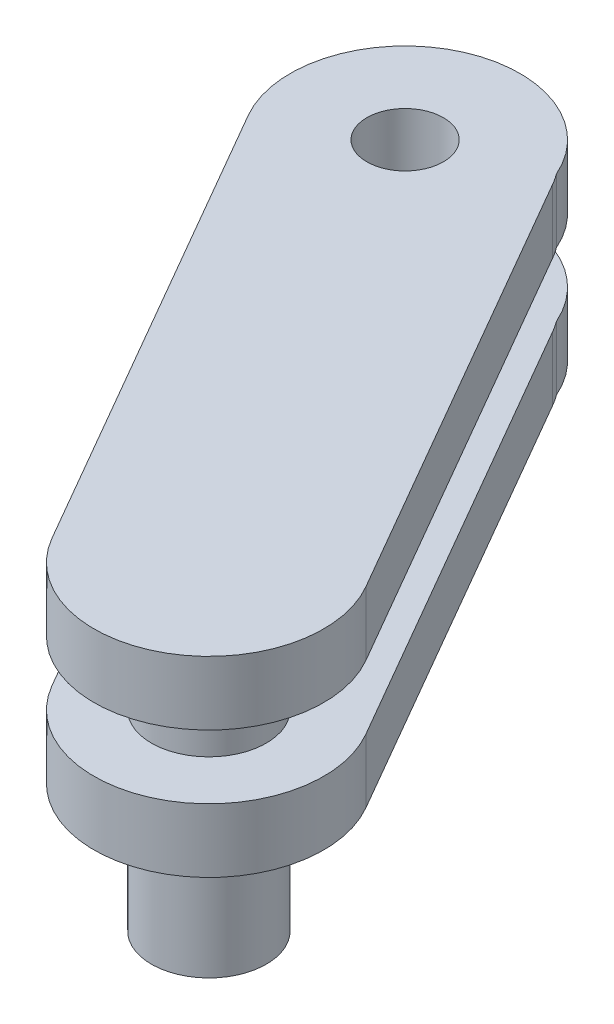
ISO-10303-21;
HEADER;
FILE_DESCRIPTION(('STEP AP214'),'2;1');
FILE_NAME('part.step','',(''),(''),'','','');
FILE_SCHEMA(('AUTOMOTIVE_DESIGN { 1 0 10303 214 1 1 1 1 }'));
ENDSEC;
DATA;
#1=APPLICATION_CONTEXT('core data for automotive mechanical design processes');
#2=APPLICATION_PROTOCOL_DEFINITION('international standard','automotive_design',2000,#1);
#3=PRODUCT_CONTEXT('',#1,'mechanical');
#4=PRODUCT('Part','Part','',(#3));
#5=PRODUCT_RELATED_PRODUCT_CATEGORY('part','',(#4));
#6=PRODUCT_DEFINITION_FORMATION('','',#4);
#7=PRODUCT_DEFINITION_CONTEXT('part definition',#1,'design');
#8=PRODUCT_DEFINITION('design','',#6,#7);
#9=PRODUCT_DEFINITION_SHAPE('','',#8);
#10=(LENGTH_UNIT() NAMED_UNIT(*) SI_UNIT(.MILLI.,.METRE.));
#11=(NAMED_UNIT(*) PLANE_ANGLE_UNIT() SI_UNIT($,.RADIAN.));
#12=(NAMED_UNIT(*) SI_UNIT($,.STERADIAN.) SOLID_ANGLE_UNIT());
#13=UNCERTAINTY_MEASURE_WITH_UNIT(LENGTH_MEASURE(1.E-05),#10,'distance_accuracy_value','');
#14=(GEOMETRIC_REPRESENTATION_CONTEXT(3) GLOBAL_UNCERTAINTY_ASSIGNED_CONTEXT((#13)) GLOBAL_UNIT_ASSIGNED_CONTEXT((#10,
#11,#12)) REPRESENTATION_CONTEXT('',''));
#15=CARTESIAN_POINT('',(0.,0.,0.));
#16=DIRECTION('',(0.,0.,1.));
#17=DIRECTION('',(1.,0.,0.));
#18=AXIS2_PLACEMENT_3D('',#15,#16,#17);
#19=CARTESIAN_POINT('',(-379.944100226322,100.,-20.7982370649041));
#20=DIRECTION('',(0.,1.,0.));
#21=DIRECTION('',(1.,0.,0.));
#22=AXIS2_PLACEMENT_3D('',#19,#20,#21);
#23=PLANE('',#22);
#24=CARTESIAN_POINT('',(-434.944100226293,100.,-116.061031481164));
#25=DIRECTION('',(0.,-1.,0.));
#26=DIRECTION('',(0.,0.,-1.));
#27=AXIS2_PLACEMENT_3D('',#24,#25,#26);
#28=CIRCLE('',#27,15.);
#29=CARTESIAN_POINT('',(-434.944100226293,100.,-131.061031481164));
#30=VERTEX_POINT('',#29);
#31=EDGE_CURVE('E635',#30,#30,#28,.T.);
#32=ORIENTED_EDGE('',*,*,#31,.F.);
#33=EDGE_LOOP('',(#32));
#34=FACE_BOUND('',#33,.T.);
#35=CARTESIAN_POINT('',(-429.944100226293,100.,-107.40077744332));
#36=DIRECTION('',(0.,1.,0.));
#37=DIRECTION('',(0.866025403783927,0.,-0.500000000000886));
#38=AXIS2_PLACEMENT_3D('',#35,#36,#37);
#39=CIRCLE('',#38,45.0000000000028);
#40=CARTESIAN_POINT('',(-390.972957056014,100.,-129.900777443361));
#41=VERTEX_POINT('',#40);
#42=CARTESIAN_POINT('',(-393.714266764155,100.,-134.091584237159));
#43=VERTEX_POINT('',#42);
#44=EDGE_CURVE('E220',#41,#43,#39,.T.);
#45=ORIENTED_EDGE('',*,*,#44,.F.);
#46=DIRECTION('',(-0.500000000000443,0.,-0.866025403784183));
#47=VECTOR('',#46,1.);
#48=CARTESIAN_POINT('',(-290.972957055926,100.,43.3043033134757));
#49=LINE('',#48,#47);
#50=CARTESIAN_POINT('',(-290.972956581911,100.,43.3043041348106));
#51=VERTEX_POINT('',#50);
#52=EDGE_CURVE('E239',#51,#41,#49,.T.);
#53=ORIENTED_EDGE('',*,*,#52,.F.);
#54=CARTESIAN_POINT('',(-329.944100226293,100.,65.8043033135681));
#55=DIRECTION('',(0.,1.,0.));
#56=DIRECTION('',(-0.866025403783927,0.,0.500000000000886));
#57=AXIS2_PLACEMENT_3D('',#54,#55,#56);
#58=CIRCLE('',#57,44.9999999999462);
#59=CARTESIAN_POINT('',(-368.915243396523,100.,88.304303313581));
#60=VERTEX_POINT('',#59);
#61=EDGE_CURVE('E53',#60,#51,#58,.T.);
#62=ORIENTED_EDGE('',*,*,#61,.F.);
#63=DIRECTION('',(0.500000000000442,0.,0.866025403784183));
#64=VECTOR('',#63,1.);
#65=CARTESIAN_POINT('',(-468.915243396612,100.,-84.9007774432555));
#66=LINE('',#65,#64);
#67=CARTESIAN_POINT('',(-473.915243396646,100.,-93.561031481193));
#68=VERTEX_POINT('',#67);
#69=EDGE_CURVE('E211',#68,#60,#66,.T.);
#70=ORIENTED_EDGE('',*,*,#69,.F.);
#71=CARTESIAN_POINT('',(-434.944100226293,100.,-116.061031481164));
#72=DIRECTION('',(0.,-1.,0.));
#73=DIRECTION('',(0.,0.,-1.));
#74=AXIS2_PLACEMENT_3D('',#71,#72,#73);
#75=CIRCLE('',#74,45.0000000000257);
#76=EDGE_CURVE('E184',#68,#43,#75,.T.);
#77=ORIENTED_EDGE('',*,*,#76,.T.);
#78=EDGE_LOOP('',(#45,#53,#62,#70,#77));
#79=FACE_BOUND('',#78,.T.);
#80=CARTESIAN_POINT('',(-329.944100226293,100.,65.8043033135681));
#81=DIRECTION('',(0.,-1.,0.));
#82=DIRECTION('',(1.,0.,0.));
#83=AXIS2_PLACEMENT_3D('',#80,#81,#82);
#84=CIRCLE('',#83,22.5);
#85=CARTESIAN_POINT('',(-352.444100226293,100.,65.8043033135681));
#86=VERTEX_POINT('',#85);
#87=EDGE_CURVE('E254',#86,#86,#84,.T.);
#88=ORIENTED_EDGE('',*,*,#87,.F.);
#89=EDGE_LOOP('',(#88));
#90=FACE_BOUND('',#89,.T.);
#91=ADVANCED_FACE('F43',(#34,#79,#90),#23,.F.);
#92=CARTESIAN_POINT('',(-379.944100226322,125.,-20.7982370649041));
#93=DIRECTION('',(0.,1.,0.));
#94=DIRECTION('',(1.,0.,0.));
#95=AXIS2_PLACEMENT_3D('',#92,#93,#94);
#96=PLANE('',#95);
#97=CARTESIAN_POINT('',(-434.944100226293,125.,-116.061031481164));
#98=DIRECTION('',(0.,1.,0.));
#99=DIRECTION('',(0.,0.,1.));
#100=AXIS2_PLACEMENT_3D('',#97,#98,#99);
#101=CIRCLE('',#100,15.);
#102=CARTESIAN_POINT('',(-434.944100226293,125.,-101.061031481164));
#103=VERTEX_POINT('',#102);
#104=EDGE_CURVE('E174',#103,#103,#101,.T.);
#105=ORIENTED_EDGE('',*,*,#104,.F.);
#106=EDGE_LOOP('',(#105));
#107=FACE_BOUND('',#106,.T.);
#108=DIRECTION('',(-0.500000000000443,0.,-0.866025403784183));
#109=VECTOR('',#108,1.);
#110=CARTESIAN_POINT('',(-290.972957055926,125.,43.3043033134757));
#111=LINE('',#110,#109);
#112=CARTESIAN_POINT('',(-290.972956581911,125.,43.3043041348106));
#113=VERTEX_POINT('',#112);
#114=CARTESIAN_POINT('',(-390.972957056014,125.,-129.900777443361));
#115=VERTEX_POINT('',#114);
#116=EDGE_CURVE('E263',#113,#115,#111,.T.);
#117=ORIENTED_EDGE('',*,*,#116,.T.);
#118=CARTESIAN_POINT('',(-429.944100226293,125.,-107.40077744332));
#119=DIRECTION('',(0.,1.,0.));
#120=DIRECTION('',(0.866025403783927,0.,-0.500000000000886));
#121=AXIS2_PLACEMENT_3D('',#118,#119,#120);
#122=CIRCLE('',#121,45.0000000000028);
#123=CARTESIAN_POINT('',(-393.714266764155,125.,-134.091584237159));
#124=VERTEX_POINT('',#123);
#125=EDGE_CURVE('E221',#115,#124,#122,.T.);
#126=ORIENTED_EDGE('',*,*,#125,.T.);
#127=CARTESIAN_POINT('',(-434.944100226293,125.,-116.061031481164));
#128=DIRECTION('',(0.,1.,0.));
#129=DIRECTION('',(0.,0.,1.));
#130=AXIS2_PLACEMENT_3D('',#127,#128,#129);
#131=CIRCLE('',#130,45.0000000000257);
#132=CARTESIAN_POINT('',(-473.915243396646,125.,-93.561031481193));
#133=VERTEX_POINT('',#132);
#134=EDGE_CURVE('E190',#133,#124,#131,.F.);
#135=ORIENTED_EDGE('',*,*,#134,.F.);
#136=DIRECTION('',(0.500000000000442,0.,0.866025403784183));
#137=VECTOR('',#136,1.);
#138=CARTESIAN_POINT('',(-468.915243396612,125.,-84.9007774432555));
#139=LINE('',#138,#137);
#140=CARTESIAN_POINT('',(-368.915243396523,125.,88.304303313581));
#141=VERTEX_POINT('',#140);
#142=EDGE_CURVE('E210',#133,#141,#139,.T.);
#143=ORIENTED_EDGE('',*,*,#142,.T.);
#144=CARTESIAN_POINT('',(-329.944100226293,125.,65.8043033135681));
#145=DIRECTION('',(0.,1.,0.));
#146=DIRECTION('',(-0.866025403783927,0.,0.500000000000886));
#147=AXIS2_PLACEMENT_3D('',#144,#145,#146);
#148=CIRCLE('',#147,44.9999999999462);
#149=EDGE_CURVE('E11',#141,#113,#148,.T.);
#150=ORIENTED_EDGE('',*,*,#149,.T.);
#151=EDGE_LOOP('',(#117,#126,#135,#143,#150));
#152=FACE_BOUND('',#151,.T.);
#153=CARTESIAN_POINT('',(-329.944100226293,125.,65.8043033135681));
#154=DIRECTION('',(0.,-1.,0.));
#155=DIRECTION('',(1.,0.,0.));
#156=AXIS2_PLACEMENT_3D('',#153,#154,#155);
#157=CIRCLE('',#156,22.5);
#158=CARTESIAN_POINT('',(-352.444100226293,125.,65.8043033135681));
#159=VERTEX_POINT('',#158);
#160=EDGE_CURVE('E216',#159,#159,#157,.T.);
#161=ORIENTED_EDGE('',*,*,#160,.T.);
#162=EDGE_LOOP('',(#161));
#163=FACE_BOUND('',#162,.T.);
#164=ADVANCED_FACE('F306',(#107,#152,#163),#96,.T.);
#165=CARTESIAN_POINT('',(-329.944100226293,100.,65.8043033135681));
#166=DIRECTION('',(0.,1.,0.));
#167=DIRECTION('',(-0.866025403783927,0.,0.500000000000886));
#168=AXIS2_PLACEMENT_3D('',#165,#166,#167);
#169=CYLINDRICAL_SURFACE('',#168,44.9999999999462);
#170=ORIENTED_EDGE('',*,*,#61,.T.);
#171=DIRECTION('',(0.,1.,0.));
#172=VECTOR('',#171,1.);
#173=CARTESIAN_POINT('',(-290.972956581911,100.,43.3043041348106));
#174=LINE('',#173,#172);
#175=EDGE_CURVE('E233',#51,#113,#174,.T.);
#176=ORIENTED_EDGE('',*,*,#175,.T.);
#177=ORIENTED_EDGE('',*,*,#149,.F.);
#178=DIRECTION('',(0.,1.,0.));
#179=VECTOR('',#178,1.);
#180=CARTESIAN_POINT('',(-368.915243396523,100.,88.304303313581));
#181=LINE('',#180,#179);
#182=EDGE_CURVE('E206',#60,#141,#181,.T.);
#183=ORIENTED_EDGE('',*,*,#182,.F.);
#184=EDGE_LOOP('',(#170,#176,#177,#183));
#185=FACE_BOUND('',#184,.T.);
#186=ADVANCED_FACE('F313',(#185),#169,.T.);
#187=CARTESIAN_POINT('',(-290.972957055926,100.,43.3043033134757));
#188=DIRECTION('',(0.866025403784183,0.,-0.500000000000443));
#189=DIRECTION('',(0.,-1.,0.));
#190=AXIS2_PLACEMENT_3D('',#187,#188,#189);
#191=PLANE('',#190);
#192=ORIENTED_EDGE('',*,*,#52,.T.);
#193=DIRECTION('',(0.,1.,0.));
#194=VECTOR('',#193,1.);
#195=CARTESIAN_POINT('',(-390.972957056014,100.,-129.900777443361));
#196=LINE('',#195,#194);
#197=EDGE_CURVE('E224',#41,#115,#196,.T.);
#198=ORIENTED_EDGE('',*,*,#197,.T.);
#199=ORIENTED_EDGE('',*,*,#116,.F.);
#200=ORIENTED_EDGE('',*,*,#175,.F.);
#201=EDGE_LOOP('',(#192,#198,#199,#200));
#202=FACE_BOUND('',#201,.T.);
#203=ADVANCED_FACE('F332',(#202),#191,.T.);
#204=CARTESIAN_POINT('',(-429.944100226293,100.,-107.40077744332));
#205=DIRECTION('',(0.,1.,0.));
#206=DIRECTION('',(0.866025403783927,0.,-0.500000000000886));
#207=AXIS2_PLACEMENT_3D('',#204,#205,#206);
#208=CYLINDRICAL_SURFACE('',#207,45.0000000000028);
#209=DIRECTION('',(0.,-1.,0.));
#210=VECTOR('',#209,1.);
#211=CARTESIAN_POINT('',(-393.714266764155,252.279220613651,-134.091584237159));
#212=LINE('',#211,#210);
#213=EDGE_CURVE('E194',#124,#43,#212,.T.);
#214=ORIENTED_EDGE('',*,*,#213,.F.);
#215=ORIENTED_EDGE('',*,*,#125,.F.);
#216=ORIENTED_EDGE('',*,*,#197,.F.);
#217=ORIENTED_EDGE('',*,*,#44,.T.);
#218=EDGE_LOOP('',(#214,#215,#216,#217));
#219=FACE_BOUND('',#218,.T.);
#220=ADVANCED_FACE('F45',(#219),#208,.T.);
#221=CARTESIAN_POINT('',(-468.915243396612,100.,-84.9007774432555));
#222=DIRECTION('',(-0.866025403784183,0.,0.500000000000442));
#223=DIRECTION('',(0.,1.,0.));
#224=AXIS2_PLACEMENT_3D('',#221,#222,#223);
#225=PLANE('',#224);
#226=ORIENTED_EDGE('',*,*,#69,.T.);
#227=ORIENTED_EDGE('',*,*,#182,.T.);
#228=ORIENTED_EDGE('',*,*,#142,.F.);
#229=DIRECTION('',(0.,-1.,0.));
#230=VECTOR('',#229,1.);
#231=CARTESIAN_POINT('',(-473.915243396646,252.279220613651,-93.561031481193));
#232=LINE('',#231,#230);
#233=EDGE_CURVE('E189',#133,#68,#232,.T.);
#234=ORIENTED_EDGE('',*,*,#233,.T.);
#235=EDGE_LOOP('',(#226,#227,#228,#234));
#236=FACE_BOUND('',#235,.T.);
#237=ADVANCED_FACE('F334',(#236),#225,.T.);
#238=CARTESIAN_POINT('',(-379.944100226322,150.,-20.7982370649041));
#239=DIRECTION('',(0.,1.,0.));
#240=DIRECTION('',(1.,0.,0.));
#241=AXIS2_PLACEMENT_3D('',#238,#239,#240);
#242=PLANE('',#241);
#243=CARTESIAN_POINT('',(-434.944100226293,150.,-116.061031481164));
#244=DIRECTION('',(0.,1.,0.));
#245=DIRECTION('',(0.,0.,1.));
#246=AXIS2_PLACEMENT_3D('',#243,#244,#245);
#247=CIRCLE('',#246,15.);
#248=CARTESIAN_POINT('',(-434.944100226293,150.,-101.061031481164));
#249=VERTEX_POINT('',#248);
#250=EDGE_CURVE('E180',#249,#249,#247,.T.);
#251=ORIENTED_EDGE('',*,*,#250,.T.);
#252=EDGE_LOOP('',(#251));
#253=FACE_BOUND('',#252,.T.);
#254=CARTESIAN_POINT('',(-329.944100226293,150.,65.8043033135681));
#255=DIRECTION('',(0.,-1.,0.));
#256=DIRECTION('',(1.,0.,0.));
#257=AXIS2_PLACEMENT_3D('',#254,#255,#256);
#258=CIRCLE('',#257,22.5);
#259=CARTESIAN_POINT('',(-352.444100226293,150.,65.8043033135681));
#260=VERTEX_POINT('',#259);
#261=EDGE_CURVE('E188',#260,#260,#258,.T.);
#262=ORIENTED_EDGE('',*,*,#261,.F.);
#263=EDGE_LOOP('',(#262));
#264=FACE_BOUND('',#263,.T.);
#265=CARTESIAN_POINT('',(-329.944100226293,150.,65.8043033135681));
#266=DIRECTION('',(0.,1.,0.));
#267=DIRECTION('',(-0.866025403783927,0.,0.500000000000886));
#268=AXIS2_PLACEMENT_3D('',#265,#266,#267);
#269=CIRCLE('',#268,44.9999999999462);
#270=CARTESIAN_POINT('',(-368.915243396523,150.,88.304303313581));
#271=VERTEX_POINT('',#270);
#272=CARTESIAN_POINT('',(-290.972956581911,150.,43.3043041348106));
#273=VERTEX_POINT('',#272);
#274=EDGE_CURVE('E245',#271,#273,#269,.T.);
#275=ORIENTED_EDGE('',*,*,#274,.F.);
#276=DIRECTION('',(0.500000000000442,0.,0.866025403784183));
#277=VECTOR('',#276,1.);
#278=CARTESIAN_POINT('',(-468.915243396612,150.,-84.9007774432555));
#279=LINE('',#278,#277);
#280=CARTESIAN_POINT('',(-473.915243396642,150.,-93.5610314811953));
#281=VERTEX_POINT('',#280);
#282=EDGE_CURVE('E244',#281,#271,#279,.T.);
#283=ORIENTED_EDGE('',*,*,#282,.F.);
#284=CARTESIAN_POINT('',(-434.944100226293,150.,-116.061031481164));
#285=DIRECTION('',(0.,1.,0.));
#286=DIRECTION('',(0.,0.,1.));
#287=AXIS2_PLACEMENT_3D('',#284,#285,#286);
#288=CIRCLE('',#287,45.0000000000272);
#289=CARTESIAN_POINT('',(-393.714266764151,150.,-134.091584237153));
#290=VERTEX_POINT('',#289);
#291=EDGE_CURVE('E168',#281,#290,#288,.F.);
#292=ORIENTED_EDGE('',*,*,#291,.T.);
#293=CARTESIAN_POINT('',(-429.944100226293,150.,-107.40077744332));
#294=DIRECTION('',(0.,1.,0.));
#295=DIRECTION('',(0.866025403783927,0.,-0.500000000000886));
#296=AXIS2_PLACEMENT_3D('',#293,#294,#295);
#297=CIRCLE('',#296,45.0000000000028);
#298=CARTESIAN_POINT('',(-390.972957056014,150.,-129.900777443361));
#299=VERTEX_POINT('',#298);
#300=EDGE_CURVE('E66',#299,#290,#297,.T.);
#301=ORIENTED_EDGE('',*,*,#300,.F.);
#302=DIRECTION('',(-0.500000000000443,0.,-0.866025403784183));
#303=VECTOR('',#302,1.);
#304=CARTESIAN_POINT('',(-290.972957055926,150.,43.3043033134757));
#305=LINE('',#304,#303);
#306=EDGE_CURVE('E205',#273,#299,#305,.T.);
#307=ORIENTED_EDGE('',*,*,#306,.F.);
#308=EDGE_LOOP('',(#275,#283,#292,#301,#307));
#309=FACE_BOUND('',#308,.T.);
#310=ADVANCED_FACE('F282',(#253,#264,#309),#242,.F.);
#311=CARTESIAN_POINT('',(-379.944100226322,175.,-20.7982370649041));
#312=DIRECTION('',(0.,1.,0.));
#313=DIRECTION('',(1.,0.,0.));
#314=AXIS2_PLACEMENT_3D('',#311,#312,#313);
#315=PLANE('',#314);
#316=CARTESIAN_POINT('',(-434.944100226293,175.,-116.061031481164));
#317=DIRECTION('',(0.,-1.,0.));
#318=DIRECTION('',(0.,0.,-1.));
#319=AXIS2_PLACEMENT_3D('',#316,#317,#318);
#320=CIRCLE('',#319,15.);
#321=CARTESIAN_POINT('',(-434.944100226293,175.,-131.061031481164));
#322=VERTEX_POINT('',#321);
#323=EDGE_CURVE('E637',#322,#322,#320,.T.);
#324=ORIENTED_EDGE('',*,*,#323,.T.);
#325=EDGE_LOOP('',(#324));
#326=FACE_BOUND('',#325,.T.);
#327=CARTESIAN_POINT('',(-329.944100226293,175.,65.8043033135681));
#328=DIRECTION('',(0.,1.,0.));
#329=DIRECTION('',(-0.866025403783927,0.,0.500000000000886));
#330=AXIS2_PLACEMENT_3D('',#327,#328,#329);
#331=CIRCLE('',#330,44.9999999999462);
#332=CARTESIAN_POINT('',(-368.915243396523,175.,88.304303313581));
#333=VERTEX_POINT('',#332);
#334=CARTESIAN_POINT('',(-290.972956581911,175.,43.3043041348106));
#335=VERTEX_POINT('',#334);
#336=EDGE_CURVE('E248',#333,#335,#331,.T.);
#337=ORIENTED_EDGE('',*,*,#336,.T.);
#338=DIRECTION('',(-0.500000000000443,0.,-0.866025403784183));
#339=VECTOR('',#338,1.);
#340=CARTESIAN_POINT('',(-290.972957055926,175.,43.3043033134757));
#341=LINE('',#340,#339);
#342=CARTESIAN_POINT('',(-390.972957056014,175.,-129.900777443361));
#343=VERTEX_POINT('',#342);
#344=EDGE_CURVE('E226',#335,#343,#341,.T.);
#345=ORIENTED_EDGE('',*,*,#344,.T.);
#346=CARTESIAN_POINT('',(-429.944100226293,175.,-107.40077744332));
#347=DIRECTION('',(0.,1.,0.));
#348=DIRECTION('',(0.866025403783927,0.,-0.500000000000886));
#349=AXIS2_PLACEMENT_3D('',#346,#347,#348);
#350=CIRCLE('',#349,45.0000000000028);
#351=CARTESIAN_POINT('',(-393.714266764155,175.,-134.091584237159));
#352=VERTEX_POINT('',#351);
#353=EDGE_CURVE('E172',#343,#352,#350,.T.);
#354=ORIENTED_EDGE('',*,*,#353,.T.);
#355=CARTESIAN_POINT('',(-434.944100226293,175.,-116.061031481164));
#356=DIRECTION('',(0.,1.,0.));
#357=DIRECTION('',(0.,0.,1.));
#358=AXIS2_PLACEMENT_3D('',#355,#356,#357);
#359=CIRCLE('',#358,45.0000000000272);
#360=CARTESIAN_POINT('',(-473.915243396642,175.,-93.5610314811953));
#361=VERTEX_POINT('',#360);
#362=EDGE_CURVE('E167',#352,#361,#359,.T.);
#363=ORIENTED_EDGE('',*,*,#362,.T.);
#364=DIRECTION('',(0.500000000000442,0.,0.866025403784183));
#365=VECTOR('',#364,1.);
#366=CARTESIAN_POINT('',(-468.915243396612,175.,-84.9007774432555));
#367=LINE('',#366,#365);
#368=EDGE_CURVE('E152',#361,#333,#367,.T.);
#369=ORIENTED_EDGE('',*,*,#368,.T.);
#370=EDGE_LOOP('',(#337,#345,#354,#363,#369));
#371=FACE_BOUND('',#370,.T.);
#372=ADVANCED_FACE('F171',(#326,#371),#315,.T.);
#373=CARTESIAN_POINT('',(-329.944100226293,150.,65.8043033135681));
#374=DIRECTION('',(0.,1.,0.));
#375=DIRECTION('',(-0.866025403783927,0.,0.500000000000886));
#376=AXIS2_PLACEMENT_3D('',#373,#374,#375);
#377=CYLINDRICAL_SURFACE('',#376,44.9999999999462);
#378=ORIENTED_EDGE('',*,*,#274,.T.);
#379=DIRECTION('',(0.,1.,0.));
#380=VECTOR('',#379,1.);
#381=CARTESIAN_POINT('',(-290.972956581911,150.,43.3043041348106));
#382=LINE('',#381,#380);
#383=EDGE_CURVE('E47',#273,#335,#382,.T.);
#384=ORIENTED_EDGE('',*,*,#383,.T.);
#385=ORIENTED_EDGE('',*,*,#336,.F.);
#386=DIRECTION('',(0.,1.,0.));
#387=VECTOR('',#386,1.);
#388=CARTESIAN_POINT('',(-368.915243396523,150.,88.304303313581));
#389=LINE('',#388,#387);
#390=EDGE_CURVE('E158',#271,#333,#389,.T.);
#391=ORIENTED_EDGE('',*,*,#390,.F.);
#392=EDGE_LOOP('',(#378,#384,#385,#391));
#393=FACE_BOUND('',#392,.T.);
#394=ADVANCED_FACE('F287',(#393),#377,.T.);
#395=CARTESIAN_POINT('',(-290.972957055926,150.,43.3043033134757));
#396=DIRECTION('',(0.866025403784183,0.,-0.500000000000443));
#397=DIRECTION('',(0.,-1.,0.));
#398=AXIS2_PLACEMENT_3D('',#395,#396,#397);
#399=PLANE('',#398);
#400=ORIENTED_EDGE('',*,*,#306,.T.);
#401=DIRECTION('',(0.,1.,0.));
#402=VECTOR('',#401,1.);
#403=CARTESIAN_POINT('',(-390.972957056014,150.,-129.900777443361));
#404=LINE('',#403,#402);
#405=EDGE_CURVE('E201',#299,#343,#404,.T.);
#406=ORIENTED_EDGE('',*,*,#405,.T.);
#407=ORIENTED_EDGE('',*,*,#344,.F.);
#408=ORIENTED_EDGE('',*,*,#383,.F.);
#409=EDGE_LOOP('',(#400,#406,#407,#408));
#410=FACE_BOUND('',#409,.T.);
#411=ADVANCED_FACE('F290',(#410),#399,.T.);
#412=CARTESIAN_POINT('',(-429.944100226293,150.,-107.40077744332));
#413=DIRECTION('',(0.,1.,0.));
#414=DIRECTION('',(0.866025403783927,0.,-0.500000000000886));
#415=AXIS2_PLACEMENT_3D('',#412,#413,#414);
#416=CYLINDRICAL_SURFACE('',#415,45.0000000000028);
#417=DIRECTION('',(0.,1.,0.));
#418=VECTOR('',#417,1.);
#419=CARTESIAN_POINT('',(-393.714266764155,-184.568020383041,-134.091584237158));
#420=LINE('',#419,#418);
#421=EDGE_CURVE('E61',#290,#352,#420,.T.);
#422=ORIENTED_EDGE('',*,*,#421,.T.);
#423=ORIENTED_EDGE('',*,*,#353,.F.);
#424=ORIENTED_EDGE('',*,*,#405,.F.);
#425=ORIENTED_EDGE('',*,*,#300,.T.);
#426=EDGE_LOOP('',(#422,#423,#424,#425));
#427=FACE_BOUND('',#426,.T.);
#428=ADVANCED_FACE('F291',(#427),#416,.T.);
#429=CARTESIAN_POINT('',(-468.915243396612,150.,-84.9007774432555));
#430=DIRECTION('',(-0.866025403784183,0.,0.500000000000442));
#431=DIRECTION('',(0.,1.,0.));
#432=AXIS2_PLACEMENT_3D('',#429,#430,#431);
#433=PLANE('',#432);
#434=ORIENTED_EDGE('',*,*,#282,.T.);
#435=ORIENTED_EDGE('',*,*,#390,.T.);
#436=ORIENTED_EDGE('',*,*,#368,.F.);
#437=DIRECTION('',(0.,1.,0.));
#438=VECTOR('',#437,1.);
#439=CARTESIAN_POINT('',(-473.915243396642,-184.568020383041,-93.5610314811953));
#440=LINE('',#439,#438);
#441=EDGE_CURVE('E156',#281,#361,#440,.T.);
#442=ORIENTED_EDGE('',*,*,#441,.F.);
#443=EDGE_LOOP('',(#434,#435,#436,#442));
#444=FACE_BOUND('',#443,.T.);
#445=ADVANCED_FACE('F155',(#444),#433,.T.);
#446=CARTESIAN_POINT('',(-329.944100226293,50.,65.8043033135681));
#447=DIRECTION('',(0.,1.,0.));
#448=DIRECTION('',(1.,0.,0.));
#449=AXIS2_PLACEMENT_3D('',#446,#447,#448);
#450=PLANE('',#449);
#451=CARTESIAN_POINT('',(-329.944100226293,50.,65.8043033135681));
#452=DIRECTION('',(0.,1.,0.));
#453=DIRECTION('',(1.,0.,0.));
#454=AXIS2_PLACEMENT_3D('',#451,#452,#453);
#455=CIRCLE('',#454,22.5);
#456=CARTESIAN_POINT('',(-352.444100226293,50.,65.8043033135681));
#457=VERTEX_POINT('',#456);
#458=EDGE_CURVE('E253',#457,#457,#455,.T.);
#459=ORIENTED_EDGE('',*,*,#458,.F.);
#460=EDGE_LOOP('',(#459));
#461=FACE_BOUND('',#460,.T.);
#462=ADVANCED_FACE('F299',(#461),#450,.F.);
#463=CARTESIAN_POINT('',(-329.944100226293,50.,65.8043033135681));
#464=DIRECTION('',(0.,1.,0.));
#465=DIRECTION('',(1.,0.,0.));
#466=AXIS2_PLACEMENT_3D('',#463,#464,#465);
#467=CYLINDRICAL_SURFACE('',#466,22.5);
#468=ORIENTED_EDGE('',*,*,#87,.T.);
#469=DIRECTION('',(0.,-1.,0.));
#470=VECTOR('',#469,1.);
#471=CARTESIAN_POINT('',(-352.444100226293,50.,65.8043033135681));
#472=LINE('',#471,#470);
#473=EDGE_CURVE('E249',#86,#457,#472,.T.);
#474=ORIENTED_EDGE('',*,*,#473,.T.);
#475=ORIENTED_EDGE('',*,*,#458,.T.);
#476=ORIENTED_EDGE('',*,*,#473,.F.);
#477=EDGE_LOOP('',(#468,#474,#475,#476));
#478=FACE_BOUND('',#477,.T.);
#479=ADVANCED_FACE('F320',(#478),#467,.T.);
#480=CARTESIAN_POINT('',(-329.944100226293,50.,65.8043033135681));
#481=DIRECTION('',(0.,1.,0.));
#482=DIRECTION('',(1.,0.,0.));
#483=AXIS2_PLACEMENT_3D('',#480,#481,#482);
#484=CYLINDRICAL_SURFACE('',#483,22.5);
#485=ORIENTED_EDGE('',*,*,#261,.T.);
#486=DIRECTION('',(0.,-1.,0.));
#487=VECTOR('',#486,1.);
#488=CARTESIAN_POINT('',(-352.444100226293,50.,65.8043033135681));
#489=LINE('',#488,#487);
#490=EDGE_CURVE('E212',#260,#159,#489,.T.);
#491=ORIENTED_EDGE('',*,*,#490,.T.);
#492=ORIENTED_EDGE('',*,*,#160,.F.);
#493=ORIENTED_EDGE('',*,*,#490,.F.);
#494=EDGE_LOOP('',(#485,#491,#492,#493));
#495=FACE_BOUND('',#494,.T.);
#496=ADVANCED_FACE('F346',(#495),#484,.T.);
#497=CARTESIAN_POINT('',(-434.944100226293,252.279220613651,-116.061031481164));
#498=DIRECTION('',(0.,-1.,0.));
#499=DIRECTION('',(0.,0.,-1.));
#500=AXIS2_PLACEMENT_3D('',#497,#498,#499);
#501=CYLINDRICAL_SURFACE('',#500,45.0000000000257);
#502=ORIENTED_EDGE('',*,*,#233,.F.);
#503=ORIENTED_EDGE('',*,*,#134,.T.);
#504=ORIENTED_EDGE('',*,*,#213,.T.);
#505=ORIENTED_EDGE('',*,*,#76,.F.);
#506=EDGE_LOOP('',(#502,#503,#504,#505));
#507=FACE_BOUND('',#506,.T.);
#508=ADVANCED_FACE('F350',(#507),#501,.T.);
#509=CARTESIAN_POINT('',(-434.944100226293,-184.568020383041,-116.061031481164));
#510=DIRECTION('',(0.,1.,0.));
#511=DIRECTION('',(0.,0.,1.));
#512=AXIS2_PLACEMENT_3D('',#509,#510,#511);
#513=CYLINDRICAL_SURFACE('',#512,45.0000000000272);
#514=ORIENTED_EDGE('',*,*,#291,.F.);
#515=ORIENTED_EDGE('',*,*,#441,.T.);
#516=ORIENTED_EDGE('',*,*,#362,.F.);
#517=ORIENTED_EDGE('',*,*,#421,.F.);
#518=EDGE_LOOP('',(#514,#515,#516,#517));
#519=FACE_BOUND('',#518,.T.);
#520=ADVANCED_FACE('F166',(#519),#513,.T.);
#521=CARTESIAN_POINT('',(-434.944100226293,175.,-116.061031481164));
#522=DIRECTION('',(0.,-1.,0.));
#523=DIRECTION('',(0.,0.,-1.));
#524=AXIS2_PLACEMENT_3D('',#521,#522,#523);
#525=CYLINDRICAL_SURFACE('',#524,15.);
#526=ORIENTED_EDGE('',*,*,#323,.F.);
#527=EDGE_LOOP('',(#526));
#528=FACE_BOUND('',#527,.T.);
#529=ORIENTED_EDGE('',*,*,#250,.F.);
#530=EDGE_LOOP('',(#529));
#531=FACE_BOUND('',#530,.T.);
#532=ADVANCED_FACE('F404',(#528,#531),#525,.F.);
#533=ORIENTED_EDGE('',*,*,#104,.T.);
#534=EDGE_LOOP('',(#533));
#535=FACE_BOUND('',#534,.T.);
#536=ORIENTED_EDGE('',*,*,#31,.T.);
#537=EDGE_LOOP('',(#536));
#538=FACE_BOUND('',#537,.T.);
#539=ADVANCED_FACE('F411',(#535,#538),#525,.F.);
#540=CLOSED_SHELL('',(#91,#164,#186,#203,#220,#237,#310,#372,#394,#411,#428,#445,#462,#479,#496,
#508,#520,#532,#539));
#541=MANIFOLD_SOLID_BREP('B2',#540);
#542=ADVANCED_BREP_SHAPE_REPRESENTATION('',(#18,#541),#14);
#543=SHAPE_DEFINITION_REPRESENTATION(#9,#542);
ENDSEC;
END-ISO-10303-21;
